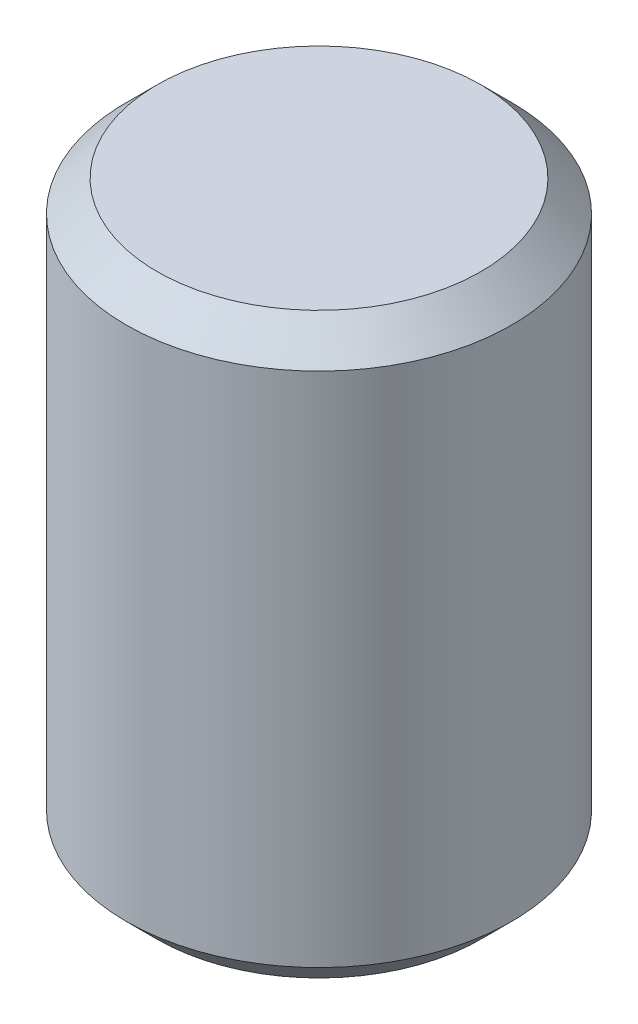
ISO-10303-21;
HEADER;
FILE_DESCRIPTION(('STEP AP214'),'2;1');
FILE_NAME('part.step','',(''),(''),'','','');
FILE_SCHEMA(('AUTOMOTIVE_DESIGN { 1 0 10303 214 1 1 1 1 }'));
ENDSEC;
DATA;
#1=APPLICATION_CONTEXT('core data for automotive mechanical design processes');
#2=APPLICATION_PROTOCOL_DEFINITION('international standard','automotive_design',2000,#1);
#3=PRODUCT_CONTEXT('',#1,'mechanical');
#4=PRODUCT('Part','Part','',(#3));
#5=PRODUCT_RELATED_PRODUCT_CATEGORY('part','',(#4));
#6=PRODUCT_DEFINITION_FORMATION('','',#4);
#7=PRODUCT_DEFINITION_CONTEXT('part definition',#1,'design');
#8=PRODUCT_DEFINITION('design','',#6,#7);
#9=PRODUCT_DEFINITION_SHAPE('','',#8);
#10=(LENGTH_UNIT() NAMED_UNIT(*) SI_UNIT(.MILLI.,.METRE.));
#11=(NAMED_UNIT(*) PLANE_ANGLE_UNIT() SI_UNIT($,.RADIAN.));
#12=(NAMED_UNIT(*) SI_UNIT($,.STERADIAN.) SOLID_ANGLE_UNIT());
#13=UNCERTAINTY_MEASURE_WITH_UNIT(LENGTH_MEASURE(1.E-05),#10,'distance_accuracy_value','');
#14=(GEOMETRIC_REPRESENTATION_CONTEXT(3) GLOBAL_UNCERTAINTY_ASSIGNED_CONTEXT((#13)) GLOBAL_UNIT_ASSIGNED_CONTEXT((#10,
#11,#12)) REPRESENTATION_CONTEXT('',''));
#15=CARTESIAN_POINT('',(0.,0.,0.));
#16=DIRECTION('',(0.,0.,1.));
#17=DIRECTION('',(1.,0.,0.));
#18=AXIS2_PLACEMENT_3D('',#15,#16,#17);
#19=CARTESIAN_POINT('',(0.,4.7625,0.));
#20=DIRECTION('',(0.,-1.,0.));
#21=DIRECTION('',(0.,0.,-1.));
#22=AXIS2_PLACEMENT_3D('',#19,#20,#21);
#23=PLANE('',#22);
#24=CARTESIAN_POINT('',(0.,4.7625,0.));
#25=DIRECTION('',(0.,-1.,0.));
#26=DIRECTION('',(0.,0.,-1.));
#27=AXIS2_PLACEMENT_3D('',#24,#25,#26);
#28=CIRCLE('',#27,2.667);
#29=CARTESIAN_POINT('',(0.,4.7625,-2.667));
#30=VERTEX_POINT('',#29);
#31=EDGE_CURVE('E10',#30,#30,#28,.F.);
#32=ORIENTED_EDGE('',*,*,#31,.T.);
#33=EDGE_LOOP('',(#32));
#34=FACE_BOUND('',#33,.T.);
#35=ADVANCED_FACE('F32',(#34),#23,.F.);
#36=CARTESIAN_POINT('',(0.,1.44707091335886,0.));
#37=DIRECTION('',(0.,1.,0.));
#38=DIRECTION('',(0.,0.,1.));
#39=AXIS2_PLACEMENT_3D('',#36,#37,#38);
#40=CYLINDRICAL_SURFACE('',#39,3.175);
#41=CARTESIAN_POINT('',(0.,-4.2545,0.));
#42=DIRECTION('',(0.,1.,0.));
#43=DIRECTION('',(0.,0.,1.));
#44=AXIS2_PLACEMENT_3D('',#41,#42,#43);
#45=CIRCLE('',#44,3.175);
#46=CARTESIAN_POINT('',(0.,-4.2545,3.175));
#47=VERTEX_POINT('',#46);
#48=EDGE_CURVE('E43',#47,#47,#45,.T.);
#49=ORIENTED_EDGE('',*,*,#48,.T.);
#50=EDGE_LOOP('',(#49));
#51=FACE_BOUND('',#50,.T.);
#52=CARTESIAN_POINT('',(0.,4.2545,0.));
#53=DIRECTION('',(0.,-1.,0.));
#54=DIRECTION('',(0.,0.,-1.));
#55=AXIS2_PLACEMENT_3D('',#52,#53,#54);
#56=CIRCLE('',#55,3.175);
#57=CARTESIAN_POINT('',(0.,4.2545,-3.175));
#58=VERTEX_POINT('',#57);
#59=EDGE_CURVE('E47',#58,#58,#56,.T.);
#60=ORIENTED_EDGE('',*,*,#59,.T.);
#61=EDGE_LOOP('',(#60));
#62=FACE_BOUND('',#61,.T.);
#63=ADVANCED_FACE('F53',(#51,#62),#40,.T.);
#64=CARTESIAN_POINT('',(3.175,-4.7625,0.));
#65=DIRECTION('',(0.,1.,0.));
#66=DIRECTION('',(0.,0.,1.));
#67=AXIS2_PLACEMENT_3D('',#64,#65,#66);
#68=PLANE('',#67);
#69=CARTESIAN_POINT('',(0.,-4.7625,0.));
#70=DIRECTION('',(0.,1.,0.));
#71=DIRECTION('',(0.,0.,1.));
#72=AXIS2_PLACEMENT_3D('',#69,#70,#71);
#73=CIRCLE('',#72,2.667);
#74=CARTESIAN_POINT('',(0.,-4.7625,2.667));
#75=VERTEX_POINT('',#74);
#76=EDGE_CURVE('E39',#75,#75,#73,.F.);
#77=ORIENTED_EDGE('',*,*,#76,.T.);
#78=EDGE_LOOP('',(#77));
#79=FACE_BOUND('',#78,.T.);
#80=ADVANCED_FACE('F61',(#79),#68,.F.);
#81=CARTESIAN_POINT('',(0.,-4.2545,0.));
#82=DIRECTION('',(0.,1.,0.));
#83=DIRECTION('',(0.,0.,1.));
#84=AXIS2_PLACEMENT_3D('',#81,#82,#83);
#85=CONICAL_SURFACE('',#84,3.175,0.78539816339745);
#86=ORIENTED_EDGE('',*,*,#76,.F.);
#87=EDGE_LOOP('',(#86));
#88=FACE_BOUND('',#87,.T.);
#89=ORIENTED_EDGE('',*,*,#48,.F.);
#90=EDGE_LOOP('',(#89));
#91=FACE_BOUND('',#90,.T.);
#92=ADVANCED_FACE('F57',(#88,#91),#85,.T.);
#93=CARTESIAN_POINT('',(0.,4.7625,0.));
#94=DIRECTION('',(0.,-1.,0.));
#95=DIRECTION('',(0.,0.,-1.));
#96=AXIS2_PLACEMENT_3D('',#93,#94,#95);
#97=CONICAL_SURFACE('',#96,2.667,0.785398163397447);
#98=ORIENTED_EDGE('',*,*,#59,.F.);
#99=EDGE_LOOP('',(#98));
#100=FACE_BOUND('',#99,.T.);
#101=ORIENTED_EDGE('',*,*,#31,.F.);
#102=EDGE_LOOP('',(#101));
#103=FACE_BOUND('',#102,.T.);
#104=ADVANCED_FACE('F34',(#100,#103),#97,.T.);
#105=CLOSED_SHELL('',(#35,#63,#80,#92,#104));
#106=MANIFOLD_SOLID_BREP('B2',#105);
#107=ADVANCED_BREP_SHAPE_REPRESENTATION('',(#18,#106),#14);
#108=SHAPE_DEFINITION_REPRESENTATION(#9,#107);
ENDSEC;
END-ISO-10303-21;
